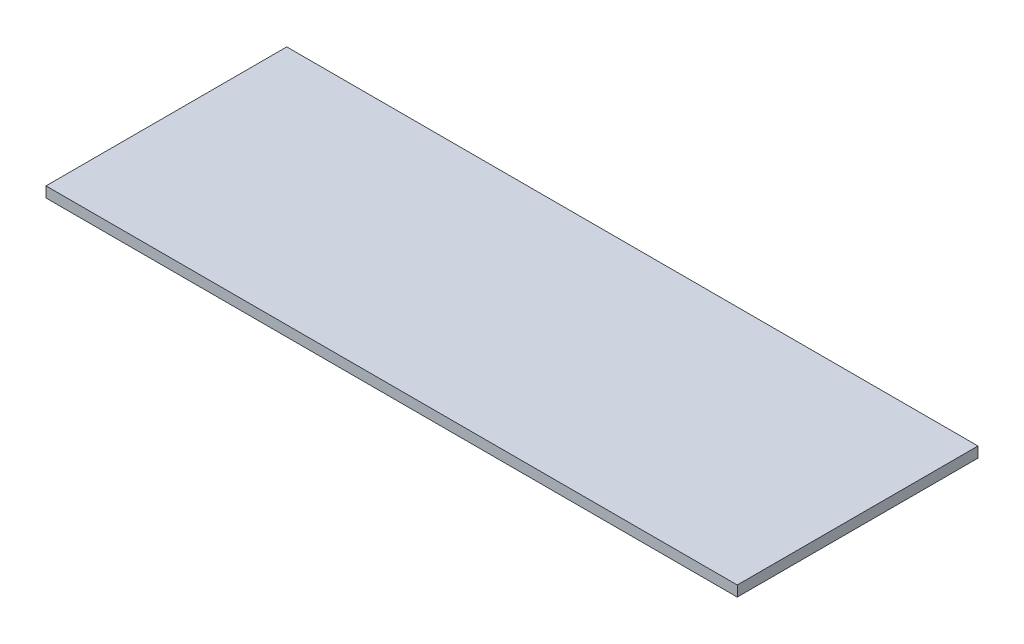
ISO-10303-21;
HEADER;
FILE_DESCRIPTION(('STEP AP214'),'2;1');
FILE_NAME('part.step','',(''),(''),'','','');
FILE_SCHEMA(('AUTOMOTIVE_DESIGN { 1 0 10303 214 1 1 1 1 }'));
ENDSEC;
DATA;
#1=APPLICATION_CONTEXT('core data for automotive mechanical design processes');
#2=APPLICATION_PROTOCOL_DEFINITION('international standard','automotive_design',2000,#1);
#3=PRODUCT_CONTEXT('',#1,'mechanical');
#4=PRODUCT('Part','Part','',(#3));
#5=PRODUCT_RELATED_PRODUCT_CATEGORY('part','',(#4));
#6=PRODUCT_DEFINITION_FORMATION('','',#4);
#7=PRODUCT_DEFINITION_CONTEXT('part definition',#1,'design');
#8=PRODUCT_DEFINITION('design','',#6,#7);
#9=PRODUCT_DEFINITION_SHAPE('','',#8);
#10=(LENGTH_UNIT() NAMED_UNIT(*) SI_UNIT(.MILLI.,.METRE.));
#11=(NAMED_UNIT(*) PLANE_ANGLE_UNIT() SI_UNIT($,.RADIAN.));
#12=(NAMED_UNIT(*) SI_UNIT($,.STERADIAN.) SOLID_ANGLE_UNIT());
#13=UNCERTAINTY_MEASURE_WITH_UNIT(LENGTH_MEASURE(1.E-05),#10,'distance_accuracy_value','');
#14=(GEOMETRIC_REPRESENTATION_CONTEXT(3) GLOBAL_UNCERTAINTY_ASSIGNED_CONTEXT((#13)) GLOBAL_UNIT_ASSIGNED_CONTEXT((#10,
#11,#12)) REPRESENTATION_CONTEXT('',''));
#15=CARTESIAN_POINT('',(0.,0.,0.));
#16=DIRECTION('',(0.,0.,1.));
#17=DIRECTION('',(1.,0.,0.));
#18=AXIS2_PLACEMENT_3D('',#15,#16,#17);
#19=CARTESIAN_POINT('',(-134.925,4.11,46.99));
#20=DIRECTION('',(1.,0.,0.));
#21=DIRECTION('',(0.,0.,-1.));
#22=AXIS2_PLACEMENT_3D('',#19,#20,#21);
#23=PLANE('',#22);
#24=DIRECTION('',(0.,0.,1.));
#25=VECTOR('',#24,1.);
#26=CARTESIAN_POINT('',(-134.925,0.,46.99));
#27=LINE('',#26,#25);
#28=CARTESIAN_POINT('',(-134.925,0.,-46.99));
#29=VERTEX_POINT('',#28);
#30=CARTESIAN_POINT('',(-134.925,0.,46.99));
#31=VERTEX_POINT('',#30);
#32=EDGE_CURVE('E96',#29,#31,#27,.T.);
#33=ORIENTED_EDGE('',*,*,#32,.T.);
#34=DIRECTION('',(0.,-1.,0.));
#35=VECTOR('',#34,1.);
#36=CARTESIAN_POINT('',(-134.925,4.11,46.99));
#37=LINE('',#36,#35);
#38=CARTESIAN_POINT('',(-134.925,4.11,46.99));
#39=VERTEX_POINT('',#38);
#40=EDGE_CURVE('E11',#39,#31,#37,.T.);
#41=ORIENTED_EDGE('',*,*,#40,.F.);
#42=DIRECTION('',(0.,0.,1.));
#43=VECTOR('',#42,1.);
#44=CARTESIAN_POINT('',(-134.925,4.11,46.99));
#45=LINE('',#44,#43);
#46=CARTESIAN_POINT('',(-134.925,4.11,-46.99));
#47=VERTEX_POINT('',#46);
#48=EDGE_CURVE('E84',#47,#39,#45,.T.);
#49=ORIENTED_EDGE('',*,*,#48,.F.);
#50=DIRECTION('',(0.,-1.,0.));
#51=VECTOR('',#50,1.);
#52=CARTESIAN_POINT('',(-134.925,4.11,-46.99));
#53=LINE('',#52,#51);
#54=EDGE_CURVE('E92',#47,#29,#53,.T.);
#55=ORIENTED_EDGE('',*,*,#54,.T.);
#56=EDGE_LOOP('',(#33,#41,#49,#55));
#57=FACE_BOUND('',#56,.T.);
#58=ADVANCED_FACE('F33',(#57),#23,.F.);
#59=CARTESIAN_POINT('',(134.925,4.11,46.99));
#60=DIRECTION('',(0.,0.,-1.));
#61=DIRECTION('',(-1.,0.,0.));
#62=AXIS2_PLACEMENT_3D('',#59,#60,#61);
#63=PLANE('',#62);
#64=DIRECTION('',(1.,0.,0.));
#65=VECTOR('',#64,1.);
#66=CARTESIAN_POINT('',(134.925,0.,46.99));
#67=LINE('',#66,#65);
#68=CARTESIAN_POINT('',(134.925,0.,46.99));
#69=VERTEX_POINT('',#68);
#70=EDGE_CURVE('E88',#31,#69,#67,.T.);
#71=ORIENTED_EDGE('',*,*,#70,.T.);
#72=DIRECTION('',(0.,-1.,0.));
#73=VECTOR('',#72,1.);
#74=CARTESIAN_POINT('',(134.925,4.11,46.99));
#75=LINE('',#74,#73);
#76=CARTESIAN_POINT('',(134.925,4.11,46.99));
#77=VERTEX_POINT('',#76);
#78=EDGE_CURVE('E41',#77,#69,#75,.T.);
#79=ORIENTED_EDGE('',*,*,#78,.F.);
#80=DIRECTION('',(1.,0.,0.));
#81=VECTOR('',#80,1.);
#82=CARTESIAN_POINT('',(134.925,4.11,46.99));
#83=LINE('',#82,#81);
#84=EDGE_CURVE('E79',#39,#77,#83,.T.);
#85=ORIENTED_EDGE('',*,*,#84,.F.);
#86=ORIENTED_EDGE('',*,*,#40,.T.);
#87=EDGE_LOOP('',(#71,#79,#85,#86));
#88=FACE_BOUND('',#87,.T.);
#89=ADVANCED_FACE('F87',(#88),#63,.F.);
#90=CARTESIAN_POINT('',(134.925,4.11,46.99));
#91=DIRECTION('',(-1.,0.,0.));
#92=DIRECTION('',(0.,0.,1.));
#93=AXIS2_PLACEMENT_3D('',#90,#91,#92);
#94=PLANE('',#93);
#95=DIRECTION('',(0.,0.,-1.));
#96=VECTOR('',#95,1.);
#97=CARTESIAN_POINT('',(134.925,0.,46.99));
#98=LINE('',#97,#96);
#99=CARTESIAN_POINT('',(134.925,0.,-46.99));
#100=VERTEX_POINT('',#99);
#101=EDGE_CURVE('E66',#69,#100,#98,.T.);
#102=ORIENTED_EDGE('',*,*,#101,.T.);
#103=DIRECTION('',(0.,-1.,0.));
#104=VECTOR('',#103,1.);
#105=CARTESIAN_POINT('',(134.925,4.11,-46.99));
#106=LINE('',#105,#104);
#107=CARTESIAN_POINT('',(134.925,4.11,-46.99));
#108=VERTEX_POINT('',#107);
#109=EDGE_CURVE('E89',#108,#100,#106,.T.);
#110=ORIENTED_EDGE('',*,*,#109,.F.);
#111=DIRECTION('',(0.,0.,-1.));
#112=VECTOR('',#111,1.);
#113=CARTESIAN_POINT('',(134.925,4.11,46.99));
#114=LINE('',#113,#112);
#115=EDGE_CURVE('E82',#77,#108,#114,.T.);
#116=ORIENTED_EDGE('',*,*,#115,.F.);
#117=ORIENTED_EDGE('',*,*,#78,.T.);
#118=EDGE_LOOP('',(#102,#110,#116,#117));
#119=FACE_BOUND('',#118,.T.);
#120=ADVANCED_FACE('F90',(#119),#94,.F.);
#121=CARTESIAN_POINT('',(134.925,4.11,-46.99));
#122=DIRECTION('',(0.,0.,1.));
#123=DIRECTION('',(1.,0.,0.));
#124=AXIS2_PLACEMENT_3D('',#121,#122,#123);
#125=PLANE('',#124);
#126=DIRECTION('',(-1.,0.,0.));
#127=VECTOR('',#126,1.);
#128=CARTESIAN_POINT('',(134.925,0.,-46.99));
#129=LINE('',#128,#127);
#130=EDGE_CURVE('E72',#100,#29,#129,.T.);
#131=ORIENTED_EDGE('',*,*,#130,.T.);
#132=ORIENTED_EDGE('',*,*,#54,.F.);
#133=DIRECTION('',(-1.,0.,0.));
#134=VECTOR('',#133,1.);
#135=CARTESIAN_POINT('',(134.925,4.11,-46.99));
#136=LINE('',#135,#134);
#137=EDGE_CURVE('E49',#108,#47,#136,.T.);
#138=ORIENTED_EDGE('',*,*,#137,.F.);
#139=ORIENTED_EDGE('',*,*,#109,.T.);
#140=EDGE_LOOP('',(#131,#132,#138,#139));
#141=FACE_BOUND('',#140,.T.);
#142=ADVANCED_FACE('F103',(#141),#125,.F.);
#143=CARTESIAN_POINT('',(0.,4.11,0.));
#144=DIRECTION('',(0.,1.,0.));
#145=DIRECTION('',(0.,0.,1.));
#146=AXIS2_PLACEMENT_3D('',#143,#144,#145);
#147=PLANE('',#146);
#148=ORIENTED_EDGE('',*,*,#48,.T.);
#149=ORIENTED_EDGE('',*,*,#84,.T.);
#150=ORIENTED_EDGE('',*,*,#115,.T.);
#151=ORIENTED_EDGE('',*,*,#137,.T.);
#152=EDGE_LOOP('',(#148,#149,#150,#151));
#153=FACE_BOUND('',#152,.T.);
#154=ADVANCED_FACE('F80',(#153),#147,.T.);
#155=CARTESIAN_POINT('',(0.,0.,0.));
#156=DIRECTION('',(0.,1.,0.));
#157=DIRECTION('',(0.,0.,1.));
#158=AXIS2_PLACEMENT_3D('',#155,#156,#157);
#159=PLANE('',#158);
#160=ORIENTED_EDGE('',*,*,#32,.F.);
#161=ORIENTED_EDGE('',*,*,#130,.F.);
#162=ORIENTED_EDGE('',*,*,#101,.F.);
#163=ORIENTED_EDGE('',*,*,#70,.F.);
#164=EDGE_LOOP('',(#160,#161,#162,#163));
#165=FACE_BOUND('',#164,.T.);
#166=ADVANCED_FACE('F106',(#165),#159,.F.);
#167=CLOSED_SHELL('',(#58,#89,#120,#142,#154,#166));
#168=MANIFOLD_SOLID_BREP('B2',#167);
#169=ADVANCED_BREP_SHAPE_REPRESENTATION('',(#18,#168),#14);
#170=SHAPE_DEFINITION_REPRESENTATION(#9,#169);
ENDSEC;
END-ISO-10303-21;
